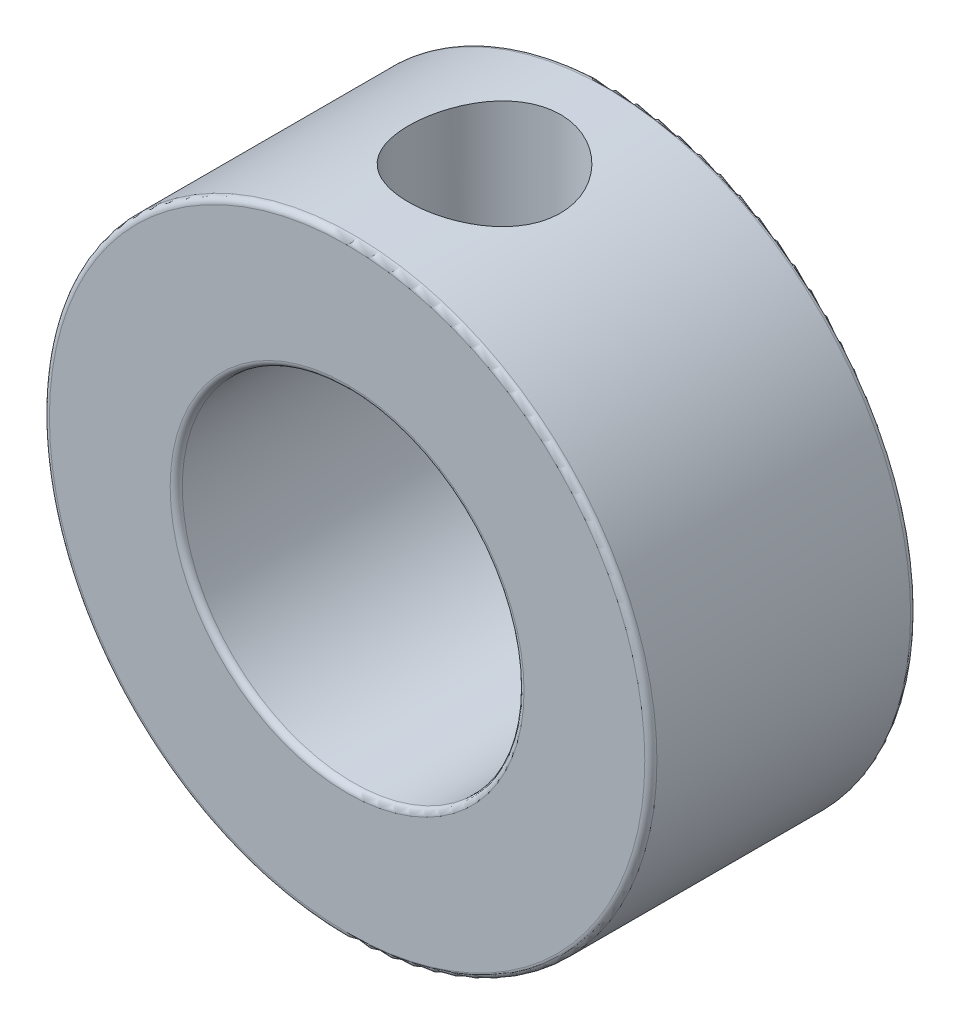
ISO-10303-21;
HEADER;
FILE_DESCRIPTION(('STEP AP214'),'2;1');
FILE_NAME('part.step','',(''),(''),'','','');
FILE_SCHEMA(('AUTOMOTIVE_DESIGN { 1 0 10303 214 1 1 1 1 }'));
ENDSEC;
DATA;
#1=APPLICATION_CONTEXT('core data for automotive mechanical design processes');
#2=APPLICATION_PROTOCOL_DEFINITION('international standard','automotive_design',2000,#1);
#3=PRODUCT_CONTEXT('',#1,'mechanical');
#4=PRODUCT('Part','Part','',(#3));
#5=PRODUCT_RELATED_PRODUCT_CATEGORY('part','',(#4));
#6=PRODUCT_DEFINITION_FORMATION('','',#4);
#7=PRODUCT_DEFINITION_CONTEXT('part definition',#1,'design');
#8=PRODUCT_DEFINITION('design','',#6,#7);
#9=PRODUCT_DEFINITION_SHAPE('','',#8);
#10=(LENGTH_UNIT() NAMED_UNIT(*) SI_UNIT(.MILLI.,.METRE.));
#11=(NAMED_UNIT(*) PLANE_ANGLE_UNIT() SI_UNIT($,.RADIAN.));
#12=(NAMED_UNIT(*) SI_UNIT($,.STERADIAN.) SOLID_ANGLE_UNIT());
#13=UNCERTAINTY_MEASURE_WITH_UNIT(LENGTH_MEASURE(1.E-05),#10,'distance_accuracy_value','');
#14=(GEOMETRIC_REPRESENTATION_CONTEXT(3) GLOBAL_UNCERTAINTY_ASSIGNED_CONTEXT((#13)) GLOBAL_UNIT_ASSIGNED_CONTEXT((#10,
#11,#12)) REPRESENTATION_CONTEXT('',''));
#15=CARTESIAN_POINT('',(0.,0.,0.));
#16=DIRECTION('',(0.,0.,1.));
#17=DIRECTION('',(1.,0.,0.));
#18=AXIS2_PLACEMENT_3D('',#15,#16,#17);
#19=CARTESIAN_POINT('',(0.,0.,11.1125));
#20=DIRECTION('',(0.,0.,1.));
#21=DIRECTION('',(1.,0.,0.));
#22=AXIS2_PLACEMENT_3D('',#19,#20,#21);
#23=PLANE('',#22);
#24=CARTESIAN_POINT('',(0.,0.,11.1125));
#25=DIRECTION('',(0.,0.,1.));
#26=DIRECTION('',(1.,0.,0.));
#27=AXIS2_PLACEMENT_3D('',#24,#25,#26);
#28=CIRCLE('',#27,12.446);
#29=CARTESIAN_POINT('',(12.446,0.,11.1125));
#30=VERTEX_POINT('',#29);
#31=EDGE_CURVE('E10',#30,#30,#28,.T.);
#32=ORIENTED_EDGE('',*,*,#31,.T.);
#33=EDGE_LOOP('',(#32));
#34=FACE_BOUND('',#33,.T.);
#35=CARTESIAN_POINT('',(0.,0.,11.1125));
#36=DIRECTION('',(0.,0.,1.));
#37=DIRECTION('',(1.,0.,0.));
#38=AXIS2_PLACEMENT_3D('',#35,#36,#37);
#39=CIRCLE('',#38,7.39775);
#40=CARTESIAN_POINT('',(7.39775,0.,11.1125));
#41=VERTEX_POINT('',#40);
#42=EDGE_CURVE('E51',#41,#41,#39,.F.);
#43=ORIENTED_EDGE('',*,*,#42,.T.);
#44=EDGE_LOOP('',(#43));
#45=FACE_BOUND('',#44,.T.);
#46=ADVANCED_FACE('F37',(#34,#45),#23,.T.);
#47=CARTESIAN_POINT('',(0.,0.,0.));
#48=DIRECTION('',(0.,0.,1.));
#49=DIRECTION('',(1.,0.,0.));
#50=AXIS2_PLACEMENT_3D('',#47,#48,#49);
#51=PLANE('',#50);
#52=CARTESIAN_POINT('',(0.,0.,0.));
#53=DIRECTION('',(0.,0.,1.));
#54=DIRECTION('',(1.,0.,0.));
#55=AXIS2_PLACEMENT_3D('',#52,#53,#54);
#56=CIRCLE('',#55,7.39775);
#57=CARTESIAN_POINT('',(7.39775,0.,0.));
#58=VERTEX_POINT('',#57);
#59=EDGE_CURVE('E74',#58,#58,#56,.T.);
#60=ORIENTED_EDGE('',*,*,#59,.T.);
#61=EDGE_LOOP('',(#60));
#62=FACE_BOUND('',#61,.T.);
#63=CARTESIAN_POINT('',(0.,0.,0.));
#64=DIRECTION('',(0.,0.,1.));
#65=DIRECTION('',(1.,0.,0.));
#66=AXIS2_PLACEMENT_3D('',#63,#64,#65);
#67=CIRCLE('',#66,12.446);
#68=CARTESIAN_POINT('',(12.446,0.,0.));
#69=VERTEX_POINT('',#68);
#70=EDGE_CURVE('E78',#69,#69,#67,.F.);
#71=ORIENTED_EDGE('',*,*,#70,.T.);
#72=EDGE_LOOP('',(#71));
#73=FACE_BOUND('',#72,.T.);
#74=ADVANCED_FACE('F105',(#62,#73),#51,.F.);
#75=CARTESIAN_POINT('',(0.,0.,11.1125));
#76=DIRECTION('',(0.,0.,-1.));
#77=DIRECTION('',(-1.,0.,0.));
#78=AXIS2_PLACEMENT_3D('',#75,#76,#77);
#79=CYLINDRICAL_SURFACE('',#78,12.7);
#80=CARTESIAN_POINT('',(-3.19154941982791,12.2924371993839,5.35110834337819));
#81=CARTESIAN_POINT('',(-3.19154444415081,12.2924405529918,5.17578388970144));
#82=CARTESIAN_POINT('',(-3.17698286718791,12.2962473726683,5.00040432205647));
#83=CARTESIAN_POINT('',(-3.11921374567852,12.3110261084819,4.65468151909783));
#84=CARTESIAN_POINT('',(-3.0759895293653,12.3220021946027,4.4843412752036));
#85=CARTESIAN_POINT('',(-2.96238025758934,12.3498054081389,4.15374784988047));
#86=CARTESIAN_POINT('',(-2.89203026508306,12.3666249794606,3.99348195603834));
#87=CARTESIAN_POINT('',(-2.7262713136133,12.4042185139072,3.68701356065254));
#88=CARTESIAN_POINT('',(-2.63086129076071,12.4249926449072,3.54081165653632));
#89=CARTESIAN_POINT('',(-2.41544565122023,12.468677025555,3.26340405389518));
#90=CARTESIAN_POINT('',(-2.29498957172221,12.491621481218,3.13255347093364));
#91=CARTESIAN_POINT('',(-2.0338684987631,12.5367821396145,2.89269137254057));
#92=CARTESIAN_POINT('',(-1.89320161808394,12.5589982741017,2.78368189883858));
#93=CARTESIAN_POINT('',(-1.59321717374805,12.6005901047201,2.58914349948648));
#94=CARTESIAN_POINT('',(-1.43366675754557,12.6199218417549,2.50396343041314));
#95=CARTESIAN_POINT('',(-1.10194738345429,12.6531994721546,2.36177009530378));
#96=CARTESIAN_POINT('',(-0.929780291654233,12.6671461600981,2.3047526734455));
#97=CARTESIAN_POINT('',(-0.581414946134329,12.6878593045752,2.2216405934634));
#98=CARTESIAN_POINT('',(-0.405369013097468,12.6947654961119,2.19494289508344));
#99=CARTESIAN_POINT('',(-0.0511693076514673,12.7011312741844,2.17133520169825));
#100=CARTESIAN_POINT('',(0.126984149229591,12.7005919616731,2.17442080267201));
#101=CARTESIAN_POINT('',(0.476159115220862,12.6922462498891,2.20985840319588));
#102=CARTESIAN_POINT('',(0.647251160558023,12.6846013693126,2.2415594761966));
#103=CARTESIAN_POINT('',(0.98161433480869,12.6631164215142,2.33228185633979));
#104=CARTESIAN_POINT('',(1.14488504688441,12.649276024508,2.39130461780751));
#105=CARTESIAN_POINT('',(1.46068455781132,12.6167289927301,2.53552160815077));
#106=CARTESIAN_POINT('',(1.61310296896276,12.5979795191087,2.62094749009861));
#107=CARTESIAN_POINT('',(1.90167328190056,12.5576629477957,2.81537005585585));
#108=CARTESIAN_POINT('',(2.03782234727729,12.5360953601602,2.92437084045019));
#109=CARTESIAN_POINT('',(2.29386972957164,12.491818200018,3.1663384456958));
#110=CARTESIAN_POINT('',(2.41322849647483,12.4690935182472,3.29987405665983));
#111=CARTESIAN_POINT('',(2.62797658599634,12.4256097603418,3.58530030977435));
#112=CARTESIAN_POINT('',(2.72336478830366,12.4048507761062,3.7371918093319));
#113=CARTESIAN_POINT('',(2.88780721104573,12.3676087160706,4.05607668674725));
#114=CARTESIAN_POINT('',(2.95673149784444,12.3511468618115,4.22313972087545));
#115=CARTESIAN_POINT('',(3.06533974134467,12.324644069201,4.56699188783578));
#116=CARTESIAN_POINT('',(3.10502995528193,12.3146017568772,4.74377893063863));
#117=CARTESIAN_POINT('',(3.15314660099362,12.3023685349456,5.09705691032119));
#118=CARTESIAN_POINT('',(3.16237108895713,12.2999772583337,5.27343234092129));
#119=CARTESIAN_POINT('',(3.15147899252415,12.3027725300243,5.62520220284146));
#120=CARTESIAN_POINT('',(3.13136510907869,12.3079583807609,5.80059672297398));
#121=CARTESIAN_POINT('',(3.06306757991513,12.3251292224645,6.14246345986287));
#122=CARTESIAN_POINT('',(3.01534858312893,12.337001580797,6.30903470612107));
#123=CARTESIAN_POINT('',(2.89371190740408,12.3660954750624,6.63181629485191));
#124=CARTESIAN_POINT('',(2.81979112499606,12.3833176446236,6.78802540737903));
#125=CARTESIAN_POINT('',(2.64618077585523,12.4215841493219,7.08902876626914));
#126=CARTESIAN_POINT('',(2.54601414496327,12.4426968369644,7.23353897023277));
#127=CARTESIAN_POINT('',(2.32336120674609,12.486185682754,7.50399756413605));
#128=CARTESIAN_POINT('',(2.20087123147517,12.5085620481183,7.62994289752382));
#129=CARTESIAN_POINT('',(1.93338900122395,12.5527208751396,7.86292836744325));
#130=CARTESIAN_POINT('',(1.78791039764557,12.574474467584,7.96941662281516));
#131=CARTESIAN_POINT('',(1.48067752672541,12.6143391803705,8.15645689440627));
#132=CARTESIAN_POINT('',(1.31892410890697,12.632450490687,8.2370102634706));
#133=CARTESIAN_POINT('',(0.984853041057339,12.6628576268286,8.36919480722865));
#134=CARTESIAN_POINT('',(0.812621672041505,12.6751951732697,8.42103398453959));
#135=CARTESIAN_POINT('',(0.461545425835523,12.6928259995256,8.49494296833086));
#136=CARTESIAN_POINT('',(0.282701831828951,12.698120638805,8.51701851997676));
#137=CARTESIAN_POINT('',(-0.0713367456970286,12.7010003607715,8.53045044028051));
#138=CARTESIAN_POINT('',(-0.246499633274665,12.6987900272945,8.5226212697561));
#139=CARTESIAN_POINT('',(-0.592920429101084,12.6873355920228,8.47833149171862));
#140=CARTESIAN_POINT('',(-0.76417845332902,12.6780916994144,8.44187173571136));
#141=CARTESIAN_POINT('',(-1.097076742199,12.6536222104315,8.34179254560569));
#142=CARTESIAN_POINT('',(-1.25876381973205,12.6384290837582,8.27832037910502));
#143=CARTESIAN_POINT('',(-1.56927849881552,12.6036424766072,8.12615175499104));
#144=CARTESIAN_POINT('',(-1.71810447623829,12.5840484414945,8.03745211764939));
#145=CARTESIAN_POINT('',(-2.00253535627428,12.5419709793444,7.83486247544045));
#146=CARTESIAN_POINT('',(-2.13773810147242,12.5194295765902,7.72041988965852));
#147=CARTESIAN_POINT('',(-2.38729611528974,12.4742509318086,7.4706657883501));
#148=CARTESIAN_POINT('',(-2.50164609020523,12.4516136669339,7.33534898972523));
#149=CARTESIAN_POINT('',(-2.70834939345135,12.4083129611744,7.04464885332664));
#150=CARTESIAN_POINT('',(-2.80025255496559,12.3876942225833,6.8889382516935));
#151=CARTESIAN_POINT('',(-2.95644640741093,12.3513521815306,6.56378216302563));
#152=CARTESIAN_POINT('',(-3.02075718796031,12.3356253196657,6.39434677603022));
#153=CARTESIAN_POINT('',(-3.11036895396224,12.313297471813,6.07952633080155));
#154=CARTESIAN_POINT('',(-3.14074531906617,12.3055335234733,5.9356475464522));
#155=CARTESIAN_POINT('',(-3.18133677677813,12.2951021995598,5.64489468431053));
#156=CARTESIAN_POINT('',(-3.19155358917933,12.2924343892397,5.49802086310221));
#157=CARTESIAN_POINT('',(-3.19154941982791,12.2924371993839,5.35110834337819));
#158=B_SPLINE_CURVE_WITH_KNOTS('',3,(#80,#81,#82,#83,#84,#85,#86,#87,#88,#89,#90,#91,#92,#93,
#94,#95,#96,#97,#98,#99,#100,#101,#102,#103,#104,#105,#106,#107,#108,#109,#110,#111,#112,#113,
#114,#115,#116,#117,#118,#119,#120,#121,#122,#123,#124,#125,#126,#127,#128,#129,#130,#131,#132,
#133,#134,#135,#136,#137,#138,#139,#140,#141,#142,#143,#144,#145,#146,#147,#148,#149,#150,#151,
#152,#153,#154,#155,#156,#157),.UNSPECIFIED.,.T.,.F.,(4,2,2,2,2,2,2,2,2,2,2,2,2,2,2,2,2,2,2,2,2,
2,2,2,2,2,2,2,2,2,2,2,2,2,2,2,2,2,4),(0.,0.52543385100489,1.0511735916144,1.57623602350084,
2.10132074979457,2.63682421825079,3.17237772279429,3.71540400425357,4.25835013005806,
4.79029713764088,5.32216548805844,5.8422319361496,6.36232607040476,6.88711950303142,
7.41200429545517,7.95109492546325,8.49021074623745,9.03194068650668,9.57355464164522,
10.1008633995054,10.628123615297,11.1467570436797,11.6654519221148,12.1943221424741,
12.7232793399028,13.2654717033223,13.8076357797011,14.3458193247107,14.8838989712075,
15.4074297658814,15.9309449907504,16.4516419323711,16.9724045329363,17.505643126655,
18.0390169009447,18.5823412615973,19.1252693614626,19.5655924052586,20.0058778838704),.UNSPECIFIED.);
#159=CARTESIAN_POINT('',(-3.19154941982791,12.2924371993839,5.35110834337819));
#160=VERTEX_POINT('',#159);
#161=EDGE_CURVE('E82',#160,#160,#158,.T.);
#162=ORIENTED_EDGE('',*,*,#161,.T.);
#163=EDGE_LOOP('',(#162));
#164=FACE_BOUND('',#163,.T.);
#165=CARTESIAN_POINT('',(0.,0.,0.254000000000001));
#166=DIRECTION('',(0.,0.,1.));
#167=DIRECTION('',(1.,0.,0.));
#168=AXIS2_PLACEMENT_3D('',#165,#166,#167);
#169=CIRCLE('',#168,12.7);
#170=CARTESIAN_POINT('',(12.7,0.,0.254000000000001));
#171=VERTEX_POINT('',#170);
#172=EDGE_CURVE('E56',#171,#171,#169,.T.);
#173=ORIENTED_EDGE('',*,*,#172,.T.);
#174=EDGE_LOOP('',(#173));
#175=FACE_BOUND('',#174,.T.);
#176=CARTESIAN_POINT('',(0.,0.,10.8585));
#177=DIRECTION('',(0.,0.,1.));
#178=DIRECTION('',(1.,0.,0.));
#179=AXIS2_PLACEMENT_3D('',#176,#177,#178);
#180=CIRCLE('',#179,12.7);
#181=CARTESIAN_POINT('',(12.7,0.,10.8585));
#182=VERTEX_POINT('',#181);
#183=EDGE_CURVE('E62',#182,#182,#180,.F.);
#184=ORIENTED_EDGE('',*,*,#183,.T.);
#185=EDGE_LOOP('',(#184));
#186=FACE_BOUND('',#185,.T.);
#187=ADVANCED_FACE('F89',(#164,#175,#186),#79,.T.);
#188=CARTESIAN_POINT('',(0.,0.,11.1125));
#189=DIRECTION('',(0.,0.,-1.));
#190=DIRECTION('',(-1.,0.,0.));
#191=AXIS2_PLACEMENT_3D('',#188,#189,#190);
#192=CYLINDRICAL_SURFACE('',#191,7.14375);
#193=CARTESIAN_POINT('',(-3.18361121165995,6.39513750559697,5.35110834337819));
#194=CARTESIAN_POINT('',(-3.18361011556372,6.3951386017266,5.2670037104865));
#195=CARTESIAN_POINT('',(-3.18026452355853,6.3968076655041,5.18287243725289));
#196=CARTESIAN_POINT('',(-3.16693117540475,6.40341744966338,5.01525330264278));
#197=CARTESIAN_POINT('',(-3.15693946674671,6.40836011688108,4.9317658540608));
#198=CARTESIAN_POINT('',(-3.11708303894445,6.42790065402683,4.68291481612566));
#199=CARTESIAN_POINT('',(-3.0773373609948,6.44721044599279,4.51937822936937));
#200=CARTESIAN_POINT('',(-2.97349525230762,6.49574445507007,4.20280702287899));
#201=CARTESIAN_POINT('',(-2.90950740209436,6.52492440225794,4.04972911569015));
#202=CARTESIAN_POINT('',(-2.7593186328749,6.5898408526042,3.75648923194634));
#203=CARTESIAN_POINT('',(-2.67312085451629,6.62557642854273,3.61632543304254));
#204=CARTESIAN_POINT('',(-2.47441465370412,6.70242325525868,3.34290917801781));
#205=CARTESIAN_POINT('',(-2.36056817920962,6.74373254894807,3.2106849946286));
#206=CARTESIAN_POINT('',(-2.11259141707627,6.82547890460923,2.96644034677946));
#207=CARTESIAN_POINT('',(-1.97845269787899,6.86591559599129,2.85442832322431));
#208=CARTESIAN_POINT('',(-1.68537965846749,6.94382882104145,2.64828834257518));
#209=CARTESIAN_POINT('',(-1.52553463618878,6.98105235973904,2.55535077818963));
#210=CARTESIAN_POINT('',(-1.19052010394492,7.04591106687987,2.39814701566491));
#211=CARTESIAN_POINT('',(-1.01535834132326,7.07355104804376,2.3338664217713));
#212=CARTESIAN_POINT('',(-0.66549940975373,7.11473584864503,2.23963266475529));
#213=CARTESIAN_POINT('',(-0.491369450868126,7.12900789316722,2.2078981205304));
#214=CARTESIAN_POINT('',(-0.139712428306699,7.1445477942349,2.17386624654412));
#215=CARTESIAN_POINT('',(0.0378130151256242,7.14582170536731,2.17155521106038));
#216=CARTESIAN_POINT('',(0.378133496823388,7.13562728152239,2.19557887900929));
#217=CARTESIAN_POINT('',(0.541099047478629,7.1250329790234,2.2199460397976));
#218=CARTESIAN_POINT('',(0.860359705619324,7.09356644627772,2.29321540220255));
#219=CARTESIAN_POINT('',(1.01665431813708,7.07269345481245,2.34211942097356));
#220=CARTESIAN_POINT('',(1.32103209467964,7.02226609319975,2.46360053966207));
#221=CARTESIAN_POINT('',(1.46895376670522,6.99258423642616,2.53652714262233));
#222=CARTESIAN_POINT('',(1.75085690325362,6.92738255676619,2.70360881100054));
#223=CARTESIAN_POINT('',(1.88483326028002,6.89186060713643,2.79777161450955));
#224=CARTESIAN_POINT('',(2.1462440895045,6.81518787445286,3.01322684274013));
#225=CARTESIAN_POINT('',(2.27233686615765,6.77381411859757,3.13606983359006));
#226=CARTESIAN_POINT('',(2.50276062712715,6.69210954931214,3.40110798100548));
#227=CARTESIAN_POINT('',(2.60708077908147,6.6517792637311,3.54331271260661));
#228=CARTESIAN_POINT('',(2.79513833813691,6.57503834303674,3.85043729740642));
#229=CARTESIAN_POINT('',(2.87783715307409,6.53886101133088,4.01605668121348));
#230=CARTESIAN_POINT('',(3.01359315334499,6.47742513652108,4.36089463847287));
#231=CARTESIAN_POINT('',(3.06667488399183,6.45215755584388,4.54010181062874));
#232=CARTESIAN_POINT('',(3.13801652109184,6.41774791228685,4.89354442046118));
#233=CARTESIAN_POINT('',(3.15847339333,6.40759189522575,5.06723530268001));
#234=CARTESIAN_POINT('',(3.17050726105737,6.4016493043197,5.4158273765555));
#235=CARTESIAN_POINT('',(3.16209678790474,6.40585649538021,5.59072801015872));
#236=CARTESIAN_POINT('',(3.11864629369509,6.42710633942059,5.92249099858904));
#237=CARTESIAN_POINT('',(3.08571276076477,6.44313274921595,6.07970334825929));
#238=CARTESIAN_POINT('',(2.99704818655867,6.48484758510928,6.38619671581266));
#239=CARTESIAN_POINT('',(2.94131130027523,6.51053848829624,6.53547568910175));
#240=CARTESIAN_POINT('',(2.8058931204405,6.57006951613398,6.82936284013462));
#241=CARTESIAN_POINT('',(2.72525198709293,6.60422285357631,6.97346311240921));
#242=CARTESIAN_POINT('',(2.54323076059093,6.67643020939175,7.24684309197127));
#243=CARTESIAN_POINT('',(2.44184091094649,6.71448605859396,7.3761157822239));
#244=CARTESIAN_POINT('',(2.20988215572734,6.79455711958069,7.62897732057766));
#245=CARTESIAN_POINT('',(2.07745629475691,6.83660502057369,7.75085955280013));
#246=CARTESIAN_POINT('',(1.79313092169897,6.91662045011176,7.97106109836167));
#247=CARTESIAN_POINT('',(1.64122866202559,6.95458740155483,8.06937708152302));
#248=CARTESIAN_POINT('',(1.32006424218863,7.02265846099116,8.24010974301545));
#249=CARTESIAN_POINT('',(1.15066481175623,7.05269259643263,8.31229789312493));
#250=CARTESIAN_POINT('',(0.800431158845642,7.10095996712613,8.42655896509107));
#251=CARTESIAN_POINT('',(0.619604876169076,7.11920129960231,8.46865255271059));
#252=CARTESIAN_POINT('',(0.266794605290448,7.14078293730987,8.51867383222843));
#253=CARTESIAN_POINT('',(0.0952126054172185,7.14516925115078,8.5289982528841));
#254=CARTESIAN_POINT('',(-0.247214543183159,7.14152216680131,8.5218302433223));
#255=CARTESIAN_POINT('',(-0.4180598466098,7.13349151757995,8.5043439700396));
#256=CARTESIAN_POINT('',(-0.746288375731106,7.10648744846772,8.44376093874833));
#257=CARTESIAN_POINT('',(-0.903932568457673,7.08801538800755,8.40183498688899));
#258=CARTESIAN_POINT('',(-1.20981779769091,7.04226117150821,8.29493042180477));
#259=CARTESIAN_POINT('',(-1.35805717927522,7.01497747004029,8.2299477645847));
#260=CARTESIAN_POINT('',(-1.64844920927786,6.9526143426875,8.0754992803237));
#261=CARTESIAN_POINT('',(-1.79001148029147,6.91723492843171,7.98504782001206));
#262=CARTESIAN_POINT('',(-2.05656703562757,6.8427247372118,7.78357878003417));
#263=CARTESIAN_POINT('',(-2.18155327106267,6.80359237643443,7.67255249881951));
#264=CARTESIAN_POINT('',(-2.42168869358202,6.72204670448835,7.42285924180776));
#265=CARTESIAN_POINT('',(-2.53528730245435,6.67961777845339,7.28270382245021));
#266=CARTESIAN_POINT('',(-2.73773009627531,6.59923547851554,6.98406351431155));
#267=CARTESIAN_POINT('',(-2.82655881989798,6.5612849084817,6.82556726414858));
#268=CARTESIAN_POINT('',(-2.93906885814595,6.51127685082549,6.57680150762425));
#269=CARTESIAN_POINT('',(-2.9731769122275,6.49572975725649,6.49181197110231));
#270=CARTESIAN_POINT('',(-3.03403721159468,6.46752734581845,6.31878916359362));
#271=CARTESIAN_POINT('',(-3.06079314163215,6.45487057990872,6.23075744229177));
#272=CARTESIAN_POINT('',(-3.10657311593775,6.43296281810693,6.05254870799606));
#273=CARTESIAN_POINT('',(-3.1256174554061,6.42370288862323,5.96237799602446));
#274=CARTESIAN_POINT('',(-3.1558131548724,6.40892294319281,5.78046784654107));
#275=CARTESIAN_POINT('',(-3.16697044555782,6.40340011725498,5.6887296409894));
#276=CARTESIAN_POINT('',(-3.1772745191117,6.39828882913505,5.55581301708028));
#277=CARTESIAN_POINT('',(-3.17964973404721,6.39710831635368,5.51491989194909));
#278=CARTESIAN_POINT('',(-3.18281836900742,6.39553237680449,5.43305606834731));
#279=CARTESIAN_POINT('',(-3.18361174569428,6.39513697154636,5.39208536778216));
#280=CARTESIAN_POINT('',(-3.18361121165995,6.39513750559697,5.35110834337819));
#281=B_SPLINE_CURVE_WITH_KNOTS('',3,(#193,#194,#195,#196,#197,#198,#199,#200,#201,#202,#203,
#204,#205,#206,#207,#208,#209,#210,#211,#212,#213,#214,#215,#216,#217,#218,#219,#220,#221,#222,
#223,#224,#225,#226,#227,#228,#229,#230,#231,#232,#233,#234,#235,#236,#237,#238,#239,#240,#241,
#242,#243,#244,#245,#246,#247,#248,#249,#250,#251,#252,#253,#254,#255,#256,#257,#258,#259,#260,
#261,#262,#263,#264,#265,#266,#267,#268,#269,#270,#271,#272,#273,#274,#275,#276,#277,#278,#279,
#280),.UNSPECIFIED.,.T.,.F.,(4,2,2,2,2,2,2,2,2,2,2,2,2,2,2,2,2,2,2,2,2,2,2,2,2,2,2,2,2,2,2,2,2,
2,2,2,2,2,2,2,2,2,2,4),(0.,0.252268349809308,0.504686860326367,1.01016208856378,
1.51339956174311,2.0165659124499,2.552173901577,3.0880050536592,3.65092482860399,
4.21356150274275,4.74342634456822,5.2730443617778,5.76608153851765,6.25915523407083,
6.75974523138415,7.26051793028565,7.80064778601011,8.34104573103691,8.90395779135837,
9.46640263978738,9.98907457994579,10.5115196561285,10.9936214601449,11.4758469150953,
11.9796505388774,12.4836916084903,13.0356159938542,13.5876183264616,14.1443383180176,
14.7006756450082,15.2138626815807,15.7269361208688,16.2172436648756,16.7076372481609,
17.2205071165107,17.7335943859857,18.2871011922453,18.8409527271707,19.1193005001475,
19.3975085147443,19.6749795128186,19.9522416432471,20.0751471571634,20.1980560382925),.UNSPECIFIED.);
#282=CARTESIAN_POINT('',(-3.18361121165995,6.39513750559697,5.35110834337819));
#283=VERTEX_POINT('',#282);
#284=EDGE_CURVE('E41',#283,#283,#281,.T.);
#285=ORIENTED_EDGE('',*,*,#284,.F.);
#286=EDGE_LOOP('',(#285));
#287=FACE_BOUND('',#286,.T.);
#288=CARTESIAN_POINT('',(0.,0.,0.254000000000001));
#289=DIRECTION('',(0.,0.,1.));
#290=DIRECTION('',(1.,0.,0.));
#291=AXIS2_PLACEMENT_3D('',#288,#289,#290);
#292=CIRCLE('',#291,7.14375);
#293=CARTESIAN_POINT('',(7.14375,0.,0.254000000000001));
#294=VERTEX_POINT('',#293);
#295=EDGE_CURVE('E66',#294,#294,#292,.F.);
#296=ORIENTED_EDGE('',*,*,#295,.T.);
#297=EDGE_LOOP('',(#296));
#298=FACE_BOUND('',#297,.T.);
#299=CARTESIAN_POINT('',(0.,0.,10.8585));
#300=DIRECTION('',(0.,0.,1.));
#301=DIRECTION('',(1.,0.,0.));
#302=AXIS2_PLACEMENT_3D('',#299,#300,#301);
#303=CIRCLE('',#302,7.14375);
#304=CARTESIAN_POINT('',(7.14375,0.,10.8585));
#305=VERTEX_POINT('',#304);
#306=EDGE_CURVE('E70',#305,#305,#303,.T.);
#307=ORIENTED_EDGE('',*,*,#306,.T.);
#308=EDGE_LOOP('',(#307));
#309=FACE_BOUND('',#308,.T.);
#310=ADVANCED_FACE('F97',(#287,#298,#309),#192,.F.);
#311=CARTESIAN_POINT('',(0.,0.,0.254000000000001));
#312=DIRECTION('',(0.,0.,1.));
#313=DIRECTION('',(1.,0.,0.));
#314=AXIS2_PLACEMENT_3D('',#311,#312,#313);
#315=TOROIDAL_SURFACE('',#314,7.39775,0.254);
#316=ORIENTED_EDGE('',*,*,#295,.F.);
#317=EDGE_LOOP('',(#316));
#318=FACE_BOUND('',#317,.T.);
#319=ORIENTED_EDGE('',*,*,#59,.F.);
#320=EDGE_LOOP('',(#319));
#321=FACE_BOUND('',#320,.T.);
#322=ADVANCED_FACE('F102',(#318,#321),#315,.T.);
#323=CARTESIAN_POINT('',(0.,0.,0.254000000000001));
#324=DIRECTION('',(0.,0.,1.));
#325=DIRECTION('',(1.,0.,0.));
#326=AXIS2_PLACEMENT_3D('',#323,#324,#325);
#327=TOROIDAL_SURFACE('',#326,12.446,0.254);
#328=ORIENTED_EDGE('',*,*,#70,.F.);
#329=EDGE_LOOP('',(#328));
#330=FACE_BOUND('',#329,.T.);
#331=ORIENTED_EDGE('',*,*,#172,.F.);
#332=EDGE_LOOP('',(#331));
#333=FACE_BOUND('',#332,.T.);
#334=ADVANCED_FACE('F116',(#330,#333),#327,.T.);
#335=CARTESIAN_POINT('',(0.,0.,10.8585));
#336=DIRECTION('',(0.,0.,1.));
#337=DIRECTION('',(1.,0.,0.));
#338=AXIS2_PLACEMENT_3D('',#335,#336,#337);
#339=TOROIDAL_SURFACE('',#338,12.446,0.254);
#340=ORIENTED_EDGE('',*,*,#183,.F.);
#341=EDGE_LOOP('',(#340));
#342=FACE_BOUND('',#341,.T.);
#343=ORIENTED_EDGE('',*,*,#31,.F.);
#344=EDGE_LOOP('',(#343));
#345=FACE_BOUND('',#344,.T.);
#346=ADVANCED_FACE('F119',(#342,#345),#339,.T.);
#347=CARTESIAN_POINT('',(0.,0.,10.8585));
#348=DIRECTION('',(0.,0.,1.));
#349=DIRECTION('',(1.,0.,0.));
#350=AXIS2_PLACEMENT_3D('',#347,#348,#349);
#351=TOROIDAL_SURFACE('',#350,7.39775,0.254);
#352=ORIENTED_EDGE('',*,*,#42,.F.);
#353=EDGE_LOOP('',(#352));
#354=FACE_BOUND('',#353,.T.);
#355=ORIENTED_EDGE('',*,*,#306,.F.);
#356=EDGE_LOOP('',(#355));
#357=FACE_BOUND('',#356,.T.);
#358=ADVANCED_FACE('F39',(#354,#357),#351,.T.);
#359=CARTESIAN_POINT('',(-0.0170951380519051,12.6999884943355,5.35110834337819));
#360=DIRECTION('',(-0.00134607386235478,0.999999094042168,0.));
#361=DIRECTION('',(-0.999999094042168,-0.00134607386235478,0.));
#362=AXIS2_PLACEMENT_3D('',#359,#360,#361);
#363=CYLINDRICAL_SURFACE('',#362,3.17499999999999);
#364=ORIENTED_EDGE('',*,*,#284,.T.);
#365=EDGE_LOOP('',(#364));
#366=FACE_BOUND('',#365,.T.);
#367=ORIENTED_EDGE('',*,*,#161,.F.);
#368=EDGE_LOOP('',(#367));
#369=FACE_BOUND('',#368,.T.);
#370=ADVANCED_FACE('F93',(#366,#369),#363,.F.);
#371=CLOSED_SHELL('',(#46,#74,#187,#310,#322,#334,#346,#358,#370));
#372=MANIFOLD_SOLID_BREP('B2',#371);
#373=ADVANCED_BREP_SHAPE_REPRESENTATION('',(#18,#372),#14);
#374=SHAPE_DEFINITION_REPRESENTATION(#9,#373);
ENDSEC;
END-ISO-10303-21;
